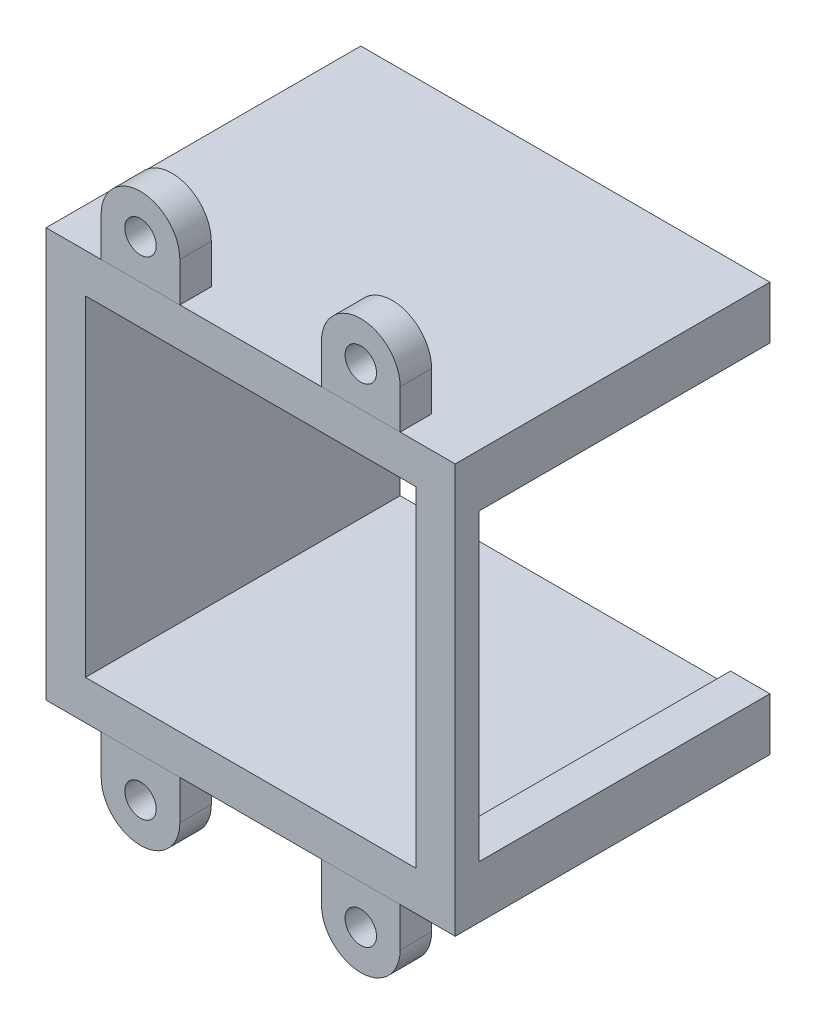
ISO-10303-21;
HEADER;
FILE_DESCRIPTION(('STEP AP214'),'2;1');
FILE_NAME('part.step','',(''),(''),'','','');
FILE_SCHEMA(('AUTOMOTIVE_DESIGN { 1 0 10303 214 1 1 1 1 }'));
ENDSEC;
DATA;
#1=APPLICATION_CONTEXT('core data for automotive mechanical design processes');
#2=APPLICATION_PROTOCOL_DEFINITION('international standard','automotive_design',2000,#1);
#3=PRODUCT_CONTEXT('',#1,'mechanical');
#4=PRODUCT('Part','Part','',(#3));
#5=PRODUCT_RELATED_PRODUCT_CATEGORY('part','',(#4));
#6=PRODUCT_DEFINITION_FORMATION('','',#4);
#7=PRODUCT_DEFINITION_CONTEXT('part definition',#1,'design');
#8=PRODUCT_DEFINITION('design','',#6,#7);
#9=PRODUCT_DEFINITION_SHAPE('','',#8);
#10=(LENGTH_UNIT() NAMED_UNIT(*) SI_UNIT(.MILLI.,.METRE.));
#11=(NAMED_UNIT(*) PLANE_ANGLE_UNIT() SI_UNIT($,.RADIAN.));
#12=(NAMED_UNIT(*) SI_UNIT($,.STERADIAN.) SOLID_ANGLE_UNIT());
#13=UNCERTAINTY_MEASURE_WITH_UNIT(LENGTH_MEASURE(1.E-05),#10,'distance_accuracy_value','');
#14=(GEOMETRIC_REPRESENTATION_CONTEXT(3) GLOBAL_UNCERTAINTY_ASSIGNED_CONTEXT((#13)) GLOBAL_UNIT_ASSIGNED_CONTEXT((#10,
#11,#12)) REPRESENTATION_CONTEXT('',''));
#15=CARTESIAN_POINT('',(0.,0.,0.));
#16=DIRECTION('',(0.,0.,1.));
#17=DIRECTION('',(1.,0.,0.));
#18=AXIS2_PLACEMENT_3D('',#15,#16,#17);
#19=CARTESIAN_POINT('',(-13.9999999999999,-31.,36.));
#20=DIRECTION('',(0.,0.,1.));
#21=DIRECTION('',(1.,0.,0.));
#22=AXIS2_PLACEMENT_3D('',#19,#20,#21);
#23=CYLINDRICAL_SURFACE('',#22,5.);
#24=CARTESIAN_POINT('',(-13.9999999999999,-31.,40.));
#25=DIRECTION('',(0.,0.,1.));
#26=DIRECTION('',(1.,0.,0.));
#27=AXIS2_PLACEMENT_3D('',#24,#25,#26);
#28=CIRCLE('',#27,5.);
#29=CARTESIAN_POINT('',(-18.9999999999999,-31.,40.));
#30=VERTEX_POINT('',#29);
#31=CARTESIAN_POINT('',(-8.99999999999991,-31.,40.));
#32=VERTEX_POINT('',#31);
#33=EDGE_CURVE('E109',#30,#32,#28,.T.);
#34=ORIENTED_EDGE('',*,*,#33,.F.);
#35=DIRECTION('',(0.,0.,1.));
#36=VECTOR('',#35,1.);
#37=CARTESIAN_POINT('',(-18.9999999999999,-31.,36.));
#38=LINE('',#37,#36);
#39=CARTESIAN_POINT('',(-18.9999999999999,-31.,36.));
#40=VERTEX_POINT('',#39);
#41=EDGE_CURVE('E12',#40,#30,#38,.T.);
#42=ORIENTED_EDGE('',*,*,#41,.F.);
#43=CARTESIAN_POINT('',(-13.9999999999999,-31.,36.));
#44=DIRECTION('',(0.,0.,1.));
#45=DIRECTION('',(1.,0.,0.));
#46=AXIS2_PLACEMENT_3D('',#43,#44,#45);
#47=CIRCLE('',#46,5.);
#48=CARTESIAN_POINT('',(-8.99999999999991,-31.,36.));
#49=VERTEX_POINT('',#48);
#50=EDGE_CURVE('E102',#40,#49,#47,.T.);
#51=ORIENTED_EDGE('',*,*,#50,.T.);
#52=DIRECTION('',(0.,0.,1.));
#53=VECTOR('',#52,1.);
#54=CARTESIAN_POINT('',(-8.99999999999991,-31.,36.));
#55=LINE('',#54,#53);
#56=EDGE_CURVE('E47',#49,#32,#55,.T.);
#57=ORIENTED_EDGE('',*,*,#56,.T.);
#58=EDGE_LOOP('',(#34,#42,#51,#57));
#59=FACE_BOUND('',#58,.T.);
#60=ADVANCED_FACE('F44',(#59),#23,.T.);
#61=CARTESIAN_POINT('',(-18.9999999999999,-26.,36.));
#62=DIRECTION('',(-1.,0.,0.));
#63=DIRECTION('',(0.,0.,1.));
#64=AXIS2_PLACEMENT_3D('',#61,#62,#63);
#65=PLANE('',#64);
#66=DIRECTION('',(0.,-1.,0.));
#67=VECTOR('',#66,1.);
#68=CARTESIAN_POINT('',(-18.9999999999999,-26.,40.));
#69=LINE('',#68,#67);
#70=CARTESIAN_POINT('',(-18.9999999999999,-26.,40.));
#71=VERTEX_POINT('',#70);
#72=EDGE_CURVE('E104',#71,#30,#69,.T.);
#73=ORIENTED_EDGE('',*,*,#72,.F.);
#74=DIRECTION('',(0.,0.,1.));
#75=VECTOR('',#74,1.);
#76=CARTESIAN_POINT('',(-18.9999999999999,-26.,36.));
#77=LINE('',#76,#75);
#78=CARTESIAN_POINT('',(-18.9999999999999,-26.,36.));
#79=VERTEX_POINT('',#78);
#80=EDGE_CURVE('E53',#79,#71,#77,.T.);
#81=ORIENTED_EDGE('',*,*,#80,.F.);
#82=DIRECTION('',(0.,-1.,0.));
#83=VECTOR('',#82,1.);
#84=CARTESIAN_POINT('',(-18.9999999999999,-26.,36.));
#85=LINE('',#84,#83);
#86=EDGE_CURVE('E99',#79,#40,#85,.T.);
#87=ORIENTED_EDGE('',*,*,#86,.T.);
#88=ORIENTED_EDGE('',*,*,#41,.T.);
#89=EDGE_LOOP('',(#73,#81,#87,#88));
#90=FACE_BOUND('',#89,.T.);
#91=ADVANCED_FACE('F120',(#90),#65,.T.);
#92=CARTESIAN_POINT('',(-8.99999999999991,-26.,36.));
#93=DIRECTION('',(0.,1.,0.));
#94=DIRECTION('',(-1.,0.,0.));
#95=AXIS2_PLACEMENT_3D('',#92,#93,#94);
#96=PLANE('',#95);
#97=DIRECTION('',(-1.,0.,0.));
#98=VECTOR('',#97,1.);
#99=CARTESIAN_POINT('',(-8.99999999999991,-26.,40.));
#100=LINE('',#99,#98);
#101=CARTESIAN_POINT('',(-8.99999999999991,-26.,40.));
#102=VERTEX_POINT('',#101);
#103=EDGE_CURVE('E94',#102,#71,#100,.T.);
#104=ORIENTED_EDGE('',*,*,#103,.F.);
#105=DIRECTION('',(0.,0.,1.));
#106=VECTOR('',#105,1.);
#107=CARTESIAN_POINT('',(-8.99999999999991,-26.,36.));
#108=LINE('',#107,#106);
#109=CARTESIAN_POINT('',(-8.99999999999991,-26.,36.));
#110=VERTEX_POINT('',#109);
#111=EDGE_CURVE('E89',#110,#102,#108,.T.);
#112=ORIENTED_EDGE('',*,*,#111,.F.);
#113=DIRECTION('',(-1.,0.,0.));
#114=VECTOR('',#113,1.);
#115=CARTESIAN_POINT('',(-8.99999999999991,-26.,36.));
#116=LINE('',#115,#114);
#117=EDGE_CURVE('E92',#110,#79,#116,.T.);
#118=ORIENTED_EDGE('',*,*,#117,.T.);
#119=ORIENTED_EDGE('',*,*,#80,.T.);
#120=EDGE_LOOP('',(#104,#112,#118,#119));
#121=FACE_BOUND('',#120,.T.);
#122=ADVANCED_FACE('F91',(#121),#96,.T.);
#123=CARTESIAN_POINT('',(-8.99999999999991,-31.,36.));
#124=DIRECTION('',(1.,0.,0.));
#125=DIRECTION('',(0.,0.,-1.));
#126=AXIS2_PLACEMENT_3D('',#123,#124,#125);
#127=PLANE('',#126);
#128=DIRECTION('',(0.,1.,0.));
#129=VECTOR('',#128,1.);
#130=CARTESIAN_POINT('',(-8.99999999999991,-31.,40.));
#131=LINE('',#130,#129);
#132=EDGE_CURVE('E112',#32,#102,#131,.T.);
#133=ORIENTED_EDGE('',*,*,#132,.F.);
#134=ORIENTED_EDGE('',*,*,#56,.F.);
#135=DIRECTION('',(0.,1.,0.));
#136=VECTOR('',#135,1.);
#137=CARTESIAN_POINT('',(-8.99999999999991,-31.,36.));
#138=LINE('',#137,#136);
#139=EDGE_CURVE('E98',#49,#110,#138,.T.);
#140=ORIENTED_EDGE('',*,*,#139,.T.);
#141=ORIENTED_EDGE('',*,*,#111,.T.);
#142=EDGE_LOOP('',(#133,#134,#140,#141));
#143=FACE_BOUND('',#142,.T.);
#144=ADVANCED_FACE('F101',(#143),#127,.T.);
#145=CARTESIAN_POINT('',(-13.9999999999999,-31.,36.));
#146=DIRECTION('',(0.,0.,1.));
#147=DIRECTION('',(1.,0.,0.));
#148=AXIS2_PLACEMENT_3D('',#145,#146,#147);
#149=PLANE('',#148);
#150=CARTESIAN_POINT('',(-13.9999999999999,-31.,36.));
#151=DIRECTION('',(0.,0.,1.));
#152=DIRECTION('',(-1.,0.,0.));
#153=AXIS2_PLACEMENT_3D('',#150,#151,#152);
#154=CIRCLE('',#153,2.);
#155=CARTESIAN_POINT('',(-15.9999999999999,-31.,36.));
#156=VERTEX_POINT('',#155);
#157=EDGE_CURVE('E113',#156,#156,#154,.T.);
#158=ORIENTED_EDGE('',*,*,#157,.T.);
#159=EDGE_LOOP('',(#158));
#160=FACE_BOUND('',#159,.T.);
#161=ORIENTED_EDGE('',*,*,#50,.F.);
#162=ORIENTED_EDGE('',*,*,#86,.F.);
#163=ORIENTED_EDGE('',*,*,#117,.F.);
#164=ORIENTED_EDGE('',*,*,#139,.F.);
#165=EDGE_LOOP('',(#161,#162,#163,#164));
#166=FACE_BOUND('',#165,.T.);
#167=ADVANCED_FACE('F97',(#160,#166),#149,.F.);
#168=CARTESIAN_POINT('',(-13.9999999999999,-31.,40.));
#169=DIRECTION('',(0.,0.,1.));
#170=DIRECTION('',(1.,0.,0.));
#171=AXIS2_PLACEMENT_3D('',#168,#169,#170);
#172=PLANE('',#171);
#173=CARTESIAN_POINT('',(-13.9999999999999,-31.,40.));
#174=DIRECTION('',(0.,0.,1.));
#175=DIRECTION('',(-1.,0.,0.));
#176=AXIS2_PLACEMENT_3D('',#173,#174,#175);
#177=CIRCLE('',#176,2.);
#178=CARTESIAN_POINT('',(-15.9999999999999,-31.,40.));
#179=VERTEX_POINT('',#178);
#180=EDGE_CURVE('E150',#179,#179,#177,.T.);
#181=ORIENTED_EDGE('',*,*,#180,.F.);
#182=EDGE_LOOP('',(#181));
#183=FACE_BOUND('',#182,.T.);
#184=ORIENTED_EDGE('',*,*,#33,.T.);
#185=ORIENTED_EDGE('',*,*,#132,.T.);
#186=ORIENTED_EDGE('',*,*,#103,.T.);
#187=ORIENTED_EDGE('',*,*,#72,.T.);
#188=EDGE_LOOP('',(#184,#185,#186,#187));
#189=FACE_BOUND('',#188,.T.);
#190=ADVANCED_FACE('F119',(#183,#189),#172,.T.);
#191=CARTESIAN_POINT('',(-13.9999999999999,-31.,36.));
#192=DIRECTION('',(0.,0.,1.));
#193=DIRECTION('',(1.,0.,0.));
#194=AXIS2_PLACEMENT_3D('',#191,#192,#193);
#195=CYLINDRICAL_SURFACE('',#194,2.);
#196=ORIENTED_EDGE('',*,*,#157,.F.);
#197=EDGE_LOOP('',(#196));
#198=FACE_BOUND('',#197,.T.);
#199=ORIENTED_EDGE('',*,*,#180,.T.);
#200=EDGE_LOOP('',(#199));
#201=FACE_BOUND('',#200,.T.);
#202=ADVANCED_FACE('F138',(#198,#201),#195,.F.);
#203=CLOSED_SHELL('',(#60,#91,#122,#144,#167,#190,#202));
#204=MANIFOLD_SOLID_BREP('B2',#203);
#205=CARTESIAN_POINT('',(14.0000000000001,-31.,36.));
#206=DIRECTION('',(0.,0.,1.));
#207=DIRECTION('',(1.,0.,0.));
#208=AXIS2_PLACEMENT_3D('',#205,#206,#207);
#209=CYLINDRICAL_SURFACE('',#208,5.);
#210=CARTESIAN_POINT('',(14.0000000000001,-31.,40.));
#211=DIRECTION('',(0.,0.,1.));
#212=DIRECTION('',(1.,0.,0.));
#213=AXIS2_PLACEMENT_3D('',#210,#211,#212);
#214=CIRCLE('',#213,5.);
#215=CARTESIAN_POINT('',(9.00000000000009,-31.,40.));
#216=VERTEX_POINT('',#215);
#217=CARTESIAN_POINT('',(19.0000000000001,-31.,40.));
#218=VERTEX_POINT('',#217);
#219=EDGE_CURVE('E264',#216,#218,#214,.T.);
#220=ORIENTED_EDGE('',*,*,#219,.F.);
#221=DIRECTION('',(0.,0.,1.));
#222=VECTOR('',#221,1.);
#223=CARTESIAN_POINT('',(9.00000000000009,-31.,36.));
#224=LINE('',#223,#222);
#225=CARTESIAN_POINT('',(9.00000000000009,-31.,36.));
#226=VERTEX_POINT('',#225);
#227=EDGE_CURVE('E42',#226,#216,#224,.T.);
#228=ORIENTED_EDGE('',*,*,#227,.F.);
#229=CARTESIAN_POINT('',(14.0000000000001,-31.,36.));
#230=DIRECTION('',(0.,0.,1.));
#231=DIRECTION('',(1.,0.,0.));
#232=AXIS2_PLACEMENT_3D('',#229,#230,#231);
#233=CIRCLE('',#232,5.);
#234=CARTESIAN_POINT('',(19.0000000000001,-31.,36.));
#235=VERTEX_POINT('',#234);
#236=EDGE_CURVE('E257',#226,#235,#233,.T.);
#237=ORIENTED_EDGE('',*,*,#236,.T.);
#238=DIRECTION('',(0.,0.,1.));
#239=VECTOR('',#238,1.);
#240=CARTESIAN_POINT('',(19.0000000000001,-31.,36.));
#241=LINE('',#240,#239);
#242=EDGE_CURVE('E202',#235,#218,#241,.T.);
#243=ORIENTED_EDGE('',*,*,#242,.T.);
#244=EDGE_LOOP('',(#220,#228,#237,#243));
#245=FACE_BOUND('',#244,.T.);
#246=ADVANCED_FACE('F199',(#245),#209,.T.);
#247=CARTESIAN_POINT('',(9.00000000000009,-26.,36.));
#248=DIRECTION('',(-1.,0.,0.));
#249=DIRECTION('',(0.,0.,1.));
#250=AXIS2_PLACEMENT_3D('',#247,#248,#249);
#251=PLANE('',#250);
#252=DIRECTION('',(0.,-1.,0.));
#253=VECTOR('',#252,1.);
#254=CARTESIAN_POINT('',(9.00000000000009,-26.,40.));
#255=LINE('',#254,#253);
#256=CARTESIAN_POINT('',(9.00000000000009,-26.,40.));
#257=VERTEX_POINT('',#256);
#258=EDGE_CURVE('E259',#257,#216,#255,.T.);
#259=ORIENTED_EDGE('',*,*,#258,.F.);
#260=DIRECTION('',(0.,0.,1.));
#261=VECTOR('',#260,1.);
#262=CARTESIAN_POINT('',(9.00000000000009,-26.,36.));
#263=LINE('',#262,#261);
#264=CARTESIAN_POINT('',(9.00000000000009,-26.,36.));
#265=VERTEX_POINT('',#264);
#266=EDGE_CURVE('E208',#265,#257,#263,.T.);
#267=ORIENTED_EDGE('',*,*,#266,.F.);
#268=DIRECTION('',(0.,-1.,0.));
#269=VECTOR('',#268,1.);
#270=CARTESIAN_POINT('',(9.00000000000009,-26.,36.));
#271=LINE('',#270,#269);
#272=EDGE_CURVE('E254',#265,#226,#271,.T.);
#273=ORIENTED_EDGE('',*,*,#272,.T.);
#274=ORIENTED_EDGE('',*,*,#227,.T.);
#275=EDGE_LOOP('',(#259,#267,#273,#274));
#276=FACE_BOUND('',#275,.T.);
#277=ADVANCED_FACE('F275',(#276),#251,.T.);
#278=CARTESIAN_POINT('',(19.0000000000001,-26.,36.));
#279=DIRECTION('',(0.,1.,0.));
#280=DIRECTION('',(-1.,0.,0.));
#281=AXIS2_PLACEMENT_3D('',#278,#279,#280);
#282=PLANE('',#281);
#283=DIRECTION('',(-1.,0.,0.));
#284=VECTOR('',#283,1.);
#285=CARTESIAN_POINT('',(19.0000000000001,-26.,40.));
#286=LINE('',#285,#284);
#287=CARTESIAN_POINT('',(19.0000000000001,-26.,40.));
#288=VERTEX_POINT('',#287);
#289=EDGE_CURVE('E249',#288,#257,#286,.T.);
#290=ORIENTED_EDGE('',*,*,#289,.F.);
#291=DIRECTION('',(0.,0.,1.));
#292=VECTOR('',#291,1.);
#293=CARTESIAN_POINT('',(19.0000000000001,-26.,36.));
#294=LINE('',#293,#292);
#295=CARTESIAN_POINT('',(19.0000000000001,-26.,36.));
#296=VERTEX_POINT('',#295);
#297=EDGE_CURVE('E244',#296,#288,#294,.T.);
#298=ORIENTED_EDGE('',*,*,#297,.F.);
#299=DIRECTION('',(-1.,0.,0.));
#300=VECTOR('',#299,1.);
#301=CARTESIAN_POINT('',(19.0000000000001,-26.,36.));
#302=LINE('',#301,#300);
#303=EDGE_CURVE('E247',#296,#265,#302,.T.);
#304=ORIENTED_EDGE('',*,*,#303,.T.);
#305=ORIENTED_EDGE('',*,*,#266,.T.);
#306=EDGE_LOOP('',(#290,#298,#304,#305));
#307=FACE_BOUND('',#306,.T.);
#308=ADVANCED_FACE('F246',(#307),#282,.T.);
#309=CARTESIAN_POINT('',(19.0000000000001,-31.,36.));
#310=DIRECTION('',(1.,0.,0.));
#311=DIRECTION('',(0.,0.,-1.));
#312=AXIS2_PLACEMENT_3D('',#309,#310,#311);
#313=PLANE('',#312);
#314=DIRECTION('',(0.,1.,0.));
#315=VECTOR('',#314,1.);
#316=CARTESIAN_POINT('',(19.0000000000001,-31.,40.));
#317=LINE('',#316,#315);
#318=EDGE_CURVE('E267',#218,#288,#317,.T.);
#319=ORIENTED_EDGE('',*,*,#318,.F.);
#320=ORIENTED_EDGE('',*,*,#242,.F.);
#321=DIRECTION('',(0.,1.,0.));
#322=VECTOR('',#321,1.);
#323=CARTESIAN_POINT('',(19.0000000000001,-31.,36.));
#324=LINE('',#323,#322);
#325=EDGE_CURVE('E253',#235,#296,#324,.T.);
#326=ORIENTED_EDGE('',*,*,#325,.T.);
#327=ORIENTED_EDGE('',*,*,#297,.T.);
#328=EDGE_LOOP('',(#319,#320,#326,#327));
#329=FACE_BOUND('',#328,.T.);
#330=ADVANCED_FACE('F256',(#329),#313,.T.);
#331=CARTESIAN_POINT('',(14.0000000000001,-31.,36.));
#332=DIRECTION('',(0.,0.,1.));
#333=DIRECTION('',(1.,0.,0.));
#334=AXIS2_PLACEMENT_3D('',#331,#332,#333);
#335=PLANE('',#334);
#336=CARTESIAN_POINT('',(14.0000000000001,-31.,36.));
#337=DIRECTION('',(0.,0.,1.));
#338=DIRECTION('',(-1.,0.,0.));
#339=AXIS2_PLACEMENT_3D('',#336,#337,#338);
#340=CIRCLE('',#339,2.);
#341=CARTESIAN_POINT('',(12.0000000000001,-31.,36.));
#342=VERTEX_POINT('',#341);
#343=EDGE_CURVE('E268',#342,#342,#340,.T.);
#344=ORIENTED_EDGE('',*,*,#343,.T.);
#345=EDGE_LOOP('',(#344));
#346=FACE_BOUND('',#345,.T.);
#347=ORIENTED_EDGE('',*,*,#236,.F.);
#348=ORIENTED_EDGE('',*,*,#272,.F.);
#349=ORIENTED_EDGE('',*,*,#303,.F.);
#350=ORIENTED_EDGE('',*,*,#325,.F.);
#351=EDGE_LOOP('',(#347,#348,#349,#350));
#352=FACE_BOUND('',#351,.T.);
#353=ADVANCED_FACE('F252',(#346,#352),#335,.F.);
#354=CARTESIAN_POINT('',(14.0000000000001,-31.,40.));
#355=DIRECTION('',(0.,0.,1.));
#356=DIRECTION('',(1.,0.,0.));
#357=AXIS2_PLACEMENT_3D('',#354,#355,#356);
#358=PLANE('',#357);
#359=CARTESIAN_POINT('',(14.0000000000001,-31.,40.));
#360=DIRECTION('',(0.,0.,1.));
#361=DIRECTION('',(-1.,0.,0.));
#362=AXIS2_PLACEMENT_3D('',#359,#360,#361);
#363=CIRCLE('',#362,2.);
#364=CARTESIAN_POINT('',(12.0000000000001,-31.,40.));
#365=VERTEX_POINT('',#364);
#366=EDGE_CURVE('E305',#365,#365,#363,.T.);
#367=ORIENTED_EDGE('',*,*,#366,.F.);
#368=EDGE_LOOP('',(#367));
#369=FACE_BOUND('',#368,.T.);
#370=ORIENTED_EDGE('',*,*,#219,.T.);
#371=ORIENTED_EDGE('',*,*,#318,.T.);
#372=ORIENTED_EDGE('',*,*,#289,.T.);
#373=ORIENTED_EDGE('',*,*,#258,.T.);
#374=EDGE_LOOP('',(#370,#371,#372,#373));
#375=FACE_BOUND('',#374,.T.);
#376=ADVANCED_FACE('F274',(#369,#375),#358,.T.);
#377=CARTESIAN_POINT('',(14.0000000000001,-31.,36.));
#378=DIRECTION('',(0.,0.,1.));
#379=DIRECTION('',(1.,0.,0.));
#380=AXIS2_PLACEMENT_3D('',#377,#378,#379);
#381=CYLINDRICAL_SURFACE('',#380,2.);
#382=ORIENTED_EDGE('',*,*,#343,.F.);
#383=EDGE_LOOP('',(#382));
#384=FACE_BOUND('',#383,.T.);
#385=ORIENTED_EDGE('',*,*,#366,.T.);
#386=EDGE_LOOP('',(#385));
#387=FACE_BOUND('',#386,.T.);
#388=ADVANCED_FACE('F293',(#384,#387),#381,.F.);
#389=CLOSED_SHELL('',(#246,#277,#308,#330,#353,#376,#388));
#390=MANIFOLD_SOLID_BREP('B6',#389);
#391=CARTESIAN_POINT('',(9.00000000000009,26.,36.));
#392=DIRECTION('',(-1.,0.,0.));
#393=DIRECTION('',(0.,0.,1.));
#394=AXIS2_PLACEMENT_3D('',#391,#392,#393);
#395=PLANE('',#394);
#396=DIRECTION('',(0.,-1.,0.));
#397=VECTOR('',#396,1.);
#398=CARTESIAN_POINT('',(9.00000000000009,26.,40.));
#399=LINE('',#398,#397);
#400=CARTESIAN_POINT('',(9.00000000000009,31.,40.));
#401=VERTEX_POINT('',#400);
#402=CARTESIAN_POINT('',(9.00000000000009,26.,40.));
#403=VERTEX_POINT('',#402);
#404=EDGE_CURVE('E419',#401,#403,#399,.T.);
#405=ORIENTED_EDGE('',*,*,#404,.F.);
#406=DIRECTION('',(0.,0.,1.));
#407=VECTOR('',#406,1.);
#408=CARTESIAN_POINT('',(9.00000000000009,31.,36.));
#409=LINE('',#408,#407);
#410=CARTESIAN_POINT('',(9.00000000000009,31.,36.));
#411=VERTEX_POINT('',#410);
#412=EDGE_CURVE('E197',#411,#401,#409,.T.);
#413=ORIENTED_EDGE('',*,*,#412,.F.);
#414=DIRECTION('',(0.,-1.,0.));
#415=VECTOR('',#414,1.);
#416=CARTESIAN_POINT('',(9.00000000000009,26.,36.));
#417=LINE('',#416,#415);
#418=CARTESIAN_POINT('',(9.00000000000009,26.,36.));
#419=VERTEX_POINT('',#418);
#420=EDGE_CURVE('E412',#411,#419,#417,.T.);
#421=ORIENTED_EDGE('',*,*,#420,.T.);
#422=DIRECTION('',(0.,0.,1.));
#423=VECTOR('',#422,1.);
#424=CARTESIAN_POINT('',(9.00000000000009,26.,36.));
#425=LINE('',#424,#423);
#426=EDGE_CURVE('E357',#419,#403,#425,.T.);
#427=ORIENTED_EDGE('',*,*,#426,.T.);
#428=EDGE_LOOP('',(#405,#413,#421,#427));
#429=FACE_BOUND('',#428,.T.);
#430=ADVANCED_FACE('F354',(#429),#395,.T.);
#431=CARTESIAN_POINT('',(14.0000000000001,31.,36.));
#432=DIRECTION('',(0.,0.,1.));
#433=DIRECTION('',(1.,0.,0.));
#434=AXIS2_PLACEMENT_3D('',#431,#432,#433);
#435=CYLINDRICAL_SURFACE('',#434,5.);
#436=CARTESIAN_POINT('',(14.0000000000001,31.,40.));
#437=DIRECTION('',(0.,0.,1.));
#438=DIRECTION('',(-1.,0.,0.));
#439=AXIS2_PLACEMENT_3D('',#436,#437,#438);
#440=CIRCLE('',#439,5.);
#441=CARTESIAN_POINT('',(19.0000000000001,31.,40.));
#442=VERTEX_POINT('',#441);
#443=EDGE_CURVE('E414',#442,#401,#440,.T.);
#444=ORIENTED_EDGE('',*,*,#443,.F.);
#445=DIRECTION('',(0.,0.,1.));
#446=VECTOR('',#445,1.);
#447=CARTESIAN_POINT('',(19.0000000000001,31.,36.));
#448=LINE('',#447,#446);
#449=CARTESIAN_POINT('',(19.0000000000001,31.,36.));
#450=VERTEX_POINT('',#449);
#451=EDGE_CURVE('E363',#450,#442,#448,.T.);
#452=ORIENTED_EDGE('',*,*,#451,.F.);
#453=CARTESIAN_POINT('',(14.0000000000001,31.,36.));
#454=DIRECTION('',(0.,0.,1.));
#455=DIRECTION('',(-1.,0.,0.));
#456=AXIS2_PLACEMENT_3D('',#453,#454,#455);
#457=CIRCLE('',#456,5.);
#458=EDGE_CURVE('E409',#450,#411,#457,.T.);
#459=ORIENTED_EDGE('',*,*,#458,.T.);
#460=ORIENTED_EDGE('',*,*,#412,.T.);
#461=EDGE_LOOP('',(#444,#452,#459,#460));
#462=FACE_BOUND('',#461,.T.);
#463=ADVANCED_FACE('F430',(#462),#435,.T.);
#464=CARTESIAN_POINT('',(19.0000000000001,31.,36.));
#465=DIRECTION('',(1.,0.,0.));
#466=DIRECTION('',(0.,0.,-1.));
#467=AXIS2_PLACEMENT_3D('',#464,#465,#466);
#468=PLANE('',#467);
#469=DIRECTION('',(0.,1.,0.));
#470=VECTOR('',#469,1.);
#471=CARTESIAN_POINT('',(19.0000000000001,31.,40.));
#472=LINE('',#471,#470);
#473=CARTESIAN_POINT('',(19.0000000000001,26.,40.));
#474=VERTEX_POINT('',#473);
#475=EDGE_CURVE('E404',#474,#442,#472,.T.);
#476=ORIENTED_EDGE('',*,*,#475,.F.);
#477=DIRECTION('',(0.,0.,1.));
#478=VECTOR('',#477,1.);
#479=CARTESIAN_POINT('',(19.0000000000001,26.,36.));
#480=LINE('',#479,#478);
#481=CARTESIAN_POINT('',(19.0000000000001,26.,36.));
#482=VERTEX_POINT('',#481);
#483=EDGE_CURVE('E399',#482,#474,#480,.T.);
#484=ORIENTED_EDGE('',*,*,#483,.F.);
#485=DIRECTION('',(0.,1.,0.));
#486=VECTOR('',#485,1.);
#487=CARTESIAN_POINT('',(19.0000000000001,31.,36.));
#488=LINE('',#487,#486);
#489=EDGE_CURVE('E402',#482,#450,#488,.T.);
#490=ORIENTED_EDGE('',*,*,#489,.T.);
#491=ORIENTED_EDGE('',*,*,#451,.T.);
#492=EDGE_LOOP('',(#476,#484,#490,#491));
#493=FACE_BOUND('',#492,.T.);
#494=ADVANCED_FACE('F401',(#493),#468,.T.);
#495=CARTESIAN_POINT('',(19.0000000000001,26.,36.));
#496=DIRECTION('',(0.,-1.,0.));
#497=DIRECTION('',(1.,0.,0.));
#498=AXIS2_PLACEMENT_3D('',#495,#496,#497);
#499=PLANE('',#498);
#500=DIRECTION('',(1.,0.,0.));
#501=VECTOR('',#500,1.);
#502=CARTESIAN_POINT('',(19.0000000000001,26.,40.));
#503=LINE('',#502,#501);
#504=EDGE_CURVE('E422',#403,#474,#503,.T.);
#505=ORIENTED_EDGE('',*,*,#504,.F.);
#506=ORIENTED_EDGE('',*,*,#426,.F.);
#507=DIRECTION('',(1.,0.,0.));
#508=VECTOR('',#507,1.);
#509=CARTESIAN_POINT('',(19.0000000000001,26.,36.));
#510=LINE('',#509,#508);
#511=EDGE_CURVE('E408',#419,#482,#510,.T.);
#512=ORIENTED_EDGE('',*,*,#511,.T.);
#513=ORIENTED_EDGE('',*,*,#483,.T.);
#514=EDGE_LOOP('',(#505,#506,#512,#513));
#515=FACE_BOUND('',#514,.T.);
#516=ADVANCED_FACE('F411',(#515),#499,.T.);
#517=CARTESIAN_POINT('',(14.0000000000001,31.,36.));
#518=DIRECTION('',(0.,0.,-1.));
#519=DIRECTION('',(-1.,0.,0.));
#520=AXIS2_PLACEMENT_3D('',#517,#518,#519);
#521=PLANE('',#520);
#522=CARTESIAN_POINT('',(14.0000000000001,31.,36.));
#523=DIRECTION('',(0.,0.,1.));
#524=DIRECTION('',(1.,0.,0.));
#525=AXIS2_PLACEMENT_3D('',#522,#523,#524);
#526=CIRCLE('',#525,2.);
#527=CARTESIAN_POINT('',(16.0000000000001,31.,36.));
#528=VERTEX_POINT('',#527);
#529=EDGE_CURVE('E423',#528,#528,#526,.T.);
#530=ORIENTED_EDGE('',*,*,#529,.T.);
#531=EDGE_LOOP('',(#530));
#532=FACE_BOUND('',#531,.T.);
#533=ORIENTED_EDGE('',*,*,#420,.F.);
#534=ORIENTED_EDGE('',*,*,#458,.F.);
#535=ORIENTED_EDGE('',*,*,#489,.F.);
#536=ORIENTED_EDGE('',*,*,#511,.F.);
#537=EDGE_LOOP('',(#533,#534,#535,#536));
#538=FACE_BOUND('',#537,.T.);
#539=ADVANCED_FACE('F407',(#532,#538),#521,.T.);
#540=CARTESIAN_POINT('',(14.0000000000001,31.,40.));
#541=DIRECTION('',(0.,0.,-1.));
#542=DIRECTION('',(-1.,0.,0.));
#543=AXIS2_PLACEMENT_3D('',#540,#541,#542);
#544=PLANE('',#543);
#545=CARTESIAN_POINT('',(14.0000000000001,31.,40.));
#546=DIRECTION('',(0.,0.,1.));
#547=DIRECTION('',(1.,0.,0.));
#548=AXIS2_PLACEMENT_3D('',#545,#546,#547);
#549=CIRCLE('',#548,2.);
#550=CARTESIAN_POINT('',(16.0000000000001,31.,40.));
#551=VERTEX_POINT('',#550);
#552=EDGE_CURVE('E460',#551,#551,#549,.T.);
#553=ORIENTED_EDGE('',*,*,#552,.F.);
#554=EDGE_LOOP('',(#553));
#555=FACE_BOUND('',#554,.T.);
#556=ORIENTED_EDGE('',*,*,#404,.T.);
#557=ORIENTED_EDGE('',*,*,#504,.T.);
#558=ORIENTED_EDGE('',*,*,#475,.T.);
#559=ORIENTED_EDGE('',*,*,#443,.T.);
#560=EDGE_LOOP('',(#556,#557,#558,#559));
#561=FACE_BOUND('',#560,.T.);
#562=ADVANCED_FACE('F429',(#555,#561),#544,.F.);
#563=CARTESIAN_POINT('',(14.0000000000001,31.,36.));
#564=DIRECTION('',(0.,0.,1.));
#565=DIRECTION('',(1.,0.,0.));
#566=AXIS2_PLACEMENT_3D('',#563,#564,#565);
#567=CYLINDRICAL_SURFACE('',#566,2.);
#568=ORIENTED_EDGE('',*,*,#529,.F.);
#569=EDGE_LOOP('',(#568));
#570=FACE_BOUND('',#569,.T.);
#571=ORIENTED_EDGE('',*,*,#552,.T.);
#572=EDGE_LOOP('',(#571));
#573=FACE_BOUND('',#572,.T.);
#574=ADVANCED_FACE('F448',(#570,#573),#567,.F.);
#575=CLOSED_SHELL('',(#430,#463,#494,#516,#539,#562,#574));
#576=MANIFOLD_SOLID_BREP('B36',#575);
#577=CARTESIAN_POINT('',(-8.99999999999991,26.,36.));
#578=DIRECTION('',(0.,-1.,0.));
#579=DIRECTION('',(1.,0.,0.));
#580=AXIS2_PLACEMENT_3D('',#577,#578,#579);
#581=PLANE('',#580);
#582=DIRECTION('',(1.,0.,0.));
#583=VECTOR('',#582,1.);
#584=CARTESIAN_POINT('',(-8.99999999999991,26.,40.));
#585=LINE('',#584,#583);
#586=CARTESIAN_POINT('',(-18.9999999999999,26.,40.));
#587=VERTEX_POINT('',#586);
#588=CARTESIAN_POINT('',(-8.99999999999991,26.,40.));
#589=VERTEX_POINT('',#588);
#590=EDGE_CURVE('E573',#587,#589,#585,.T.);
#591=ORIENTED_EDGE('',*,*,#590,.F.);
#592=DIRECTION('',(0.,0.,1.));
#593=VECTOR('',#592,1.);
#594=CARTESIAN_POINT('',(-18.9999999999999,26.,36.));
#595=LINE('',#594,#593);
#596=CARTESIAN_POINT('',(-18.9999999999999,26.,36.));
#597=VERTEX_POINT('',#596);
#598=EDGE_CURVE('E352',#597,#587,#595,.T.);
#599=ORIENTED_EDGE('',*,*,#598,.F.);
#600=DIRECTION('',(1.,0.,0.));
#601=VECTOR('',#600,1.);
#602=CARTESIAN_POINT('',(-8.99999999999991,26.,36.));
#603=LINE('',#602,#601);
#604=CARTESIAN_POINT('',(-8.99999999999991,26.,36.));
#605=VERTEX_POINT('',#604);
#606=EDGE_CURVE('E566',#597,#605,#603,.T.);
#607=ORIENTED_EDGE('',*,*,#606,.T.);
#608=DIRECTION('',(0.,0.,1.));
#609=VECTOR('',#608,1.);
#610=CARTESIAN_POINT('',(-8.99999999999991,26.,36.));
#611=LINE('',#610,#609);
#612=EDGE_CURVE('E511',#605,#589,#611,.T.);
#613=ORIENTED_EDGE('',*,*,#612,.T.);
#614=EDGE_LOOP('',(#591,#599,#607,#613));
#615=FACE_BOUND('',#614,.T.);
#616=ADVANCED_FACE('F508',(#615),#581,.T.);
#617=CARTESIAN_POINT('',(-18.9999999999999,26.,36.));
#618=DIRECTION('',(-1.,0.,0.));
#619=DIRECTION('',(0.,0.,1.));
#620=AXIS2_PLACEMENT_3D('',#617,#618,#619);
#621=PLANE('',#620);
#622=DIRECTION('',(0.,-1.,0.));
#623=VECTOR('',#622,1.);
#624=CARTESIAN_POINT('',(-18.9999999999999,26.,40.));
#625=LINE('',#624,#623);
#626=CARTESIAN_POINT('',(-18.9999999999999,31.,40.));
#627=VERTEX_POINT('',#626);
#628=EDGE_CURVE('E568',#627,#587,#625,.T.);
#629=ORIENTED_EDGE('',*,*,#628,.F.);
#630=DIRECTION('',(0.,0.,1.));
#631=VECTOR('',#630,1.);
#632=CARTESIAN_POINT('',(-18.9999999999999,31.,36.));
#633=LINE('',#632,#631);
#634=CARTESIAN_POINT('',(-18.9999999999999,31.,36.));
#635=VERTEX_POINT('',#634);
#636=EDGE_CURVE('E517',#635,#627,#633,.T.);
#637=ORIENTED_EDGE('',*,*,#636,.F.);
#638=DIRECTION('',(0.,-1.,0.));
#639=VECTOR('',#638,1.);
#640=CARTESIAN_POINT('',(-18.9999999999999,26.,36.));
#641=LINE('',#640,#639);
#642=EDGE_CURVE('E563',#635,#597,#641,.T.);
#643=ORIENTED_EDGE('',*,*,#642,.T.);
#644=ORIENTED_EDGE('',*,*,#598,.T.);
#645=EDGE_LOOP('',(#629,#637,#643,#644));
#646=FACE_BOUND('',#645,.T.);
#647=ADVANCED_FACE('F584',(#646),#621,.T.);
#648=CARTESIAN_POINT('',(-13.9999999999999,31.,36.));
#649=DIRECTION('',(0.,0.,1.));
#650=DIRECTION('',(1.,0.,0.));
#651=AXIS2_PLACEMENT_3D('',#648,#649,#650);
#652=CYLINDRICAL_SURFACE('',#651,5.);
#653=CARTESIAN_POINT('',(-13.9999999999999,31.,40.));
#654=DIRECTION('',(0.,0.,1.));
#655=DIRECTION('',(-1.,0.,0.));
#656=AXIS2_PLACEMENT_3D('',#653,#654,#655);
#657=CIRCLE('',#656,5.);
#658=CARTESIAN_POINT('',(-8.9999999999999,31.,40.));
#659=VERTEX_POINT('',#658);
#660=EDGE_CURVE('E558',#659,#627,#657,.T.);
#661=ORIENTED_EDGE('',*,*,#660,.F.);
#662=DIRECTION('',(0.,0.,1.));
#663=VECTOR('',#662,1.);
#664=CARTESIAN_POINT('',(-8.9999999999999,31.,36.));
#665=LINE('',#664,#663);
#666=CARTESIAN_POINT('',(-8.9999999999999,31.,36.));
#667=VERTEX_POINT('',#666);
#668=EDGE_CURVE('E553',#667,#659,#665,.T.);
#669=ORIENTED_EDGE('',*,*,#668,.F.);
#670=CARTESIAN_POINT('',(-13.9999999999999,31.,36.));
#671=DIRECTION('',(0.,0.,1.));
#672=DIRECTION('',(-1.,0.,0.));
#673=AXIS2_PLACEMENT_3D('',#670,#671,#672);
#674=CIRCLE('',#673,5.);
#675=EDGE_CURVE('E556',#667,#635,#674,.T.);
#676=ORIENTED_EDGE('',*,*,#675,.T.);
#677=ORIENTED_EDGE('',*,*,#636,.T.);
#678=EDGE_LOOP('',(#661,#669,#676,#677));
#679=FACE_BOUND('',#678,.T.);
#680=ADVANCED_FACE('F555',(#679),#652,.T.);
#681=CARTESIAN_POINT('',(-8.99999999999991,31.,36.));
#682=DIRECTION('',(1.,0.,0.));
#683=DIRECTION('',(0.,0.,-1.));
#684=AXIS2_PLACEMENT_3D('',#681,#682,#683);
#685=PLANE('',#684);
#686=DIRECTION('',(0.,1.,0.));
#687=VECTOR('',#686,1.);
#688=CARTESIAN_POINT('',(-8.99999999999991,31.,40.));
#689=LINE('',#688,#687);
#690=EDGE_CURVE('E576',#589,#659,#689,.T.);
#691=ORIENTED_EDGE('',*,*,#690,.F.);
#692=ORIENTED_EDGE('',*,*,#612,.F.);
#693=DIRECTION('',(0.,1.,0.));
#694=VECTOR('',#693,1.);
#695=CARTESIAN_POINT('',(-8.99999999999991,31.,36.));
#696=LINE('',#695,#694);
#697=EDGE_CURVE('E562',#605,#667,#696,.T.);
#698=ORIENTED_EDGE('',*,*,#697,.T.);
#699=ORIENTED_EDGE('',*,*,#668,.T.);
#700=EDGE_LOOP('',(#691,#692,#698,#699));
#701=FACE_BOUND('',#700,.T.);
#702=ADVANCED_FACE('F565',(#701),#685,.T.);
#703=CARTESIAN_POINT('',(-13.9999999999999,31.,36.));
#704=DIRECTION('',(0.,0.,-1.));
#705=DIRECTION('',(-1.,0.,0.));
#706=AXIS2_PLACEMENT_3D('',#703,#704,#705);
#707=PLANE('',#706);
#708=CARTESIAN_POINT('',(-13.9999999999999,31.,36.));
#709=DIRECTION('',(0.,0.,1.));
#710=DIRECTION('',(1.,0.,0.));
#711=AXIS2_PLACEMENT_3D('',#708,#709,#710);
#712=CIRCLE('',#711,2.);
#713=CARTESIAN_POINT('',(-11.9999999999999,31.,36.));
#714=VERTEX_POINT('',#713);
#715=EDGE_CURVE('E577',#714,#714,#712,.T.);
#716=ORIENTED_EDGE('',*,*,#715,.T.);
#717=EDGE_LOOP('',(#716));
#718=FACE_BOUND('',#717,.T.);
#719=ORIENTED_EDGE('',*,*,#606,.F.);
#720=ORIENTED_EDGE('',*,*,#642,.F.);
#721=ORIENTED_EDGE('',*,*,#675,.F.);
#722=ORIENTED_EDGE('',*,*,#697,.F.);
#723=EDGE_LOOP('',(#719,#720,#721,#722));
#724=FACE_BOUND('',#723,.T.);
#725=ADVANCED_FACE('F561',(#718,#724),#707,.T.);
#726=CARTESIAN_POINT('',(-13.9999999999999,31.,40.));
#727=DIRECTION('',(0.,0.,-1.));
#728=DIRECTION('',(-1.,0.,0.));
#729=AXIS2_PLACEMENT_3D('',#726,#727,#728);
#730=PLANE('',#729);
#731=CARTESIAN_POINT('',(-13.9999999999999,31.,40.));
#732=DIRECTION('',(0.,0.,1.));
#733=DIRECTION('',(1.,0.,0.));
#734=AXIS2_PLACEMENT_3D('',#731,#732,#733);
#735=CIRCLE('',#734,2.);
#736=CARTESIAN_POINT('',(-11.9999999999999,31.,40.));
#737=VERTEX_POINT('',#736);
#738=EDGE_CURVE('E614',#737,#737,#735,.T.);
#739=ORIENTED_EDGE('',*,*,#738,.F.);
#740=EDGE_LOOP('',(#739));
#741=FACE_BOUND('',#740,.T.);
#742=ORIENTED_EDGE('',*,*,#590,.T.);
#743=ORIENTED_EDGE('',*,*,#690,.T.);
#744=ORIENTED_EDGE('',*,*,#660,.T.);
#745=ORIENTED_EDGE('',*,*,#628,.T.);
#746=EDGE_LOOP('',(#742,#743,#744,#745));
#747=FACE_BOUND('',#746,.T.);
#748=ADVANCED_FACE('F583',(#741,#747),#730,.F.);
#749=CARTESIAN_POINT('',(-13.9999999999999,31.,36.));
#750=DIRECTION('',(0.,0.,1.));
#751=DIRECTION('',(1.,0.,0.));
#752=AXIS2_PLACEMENT_3D('',#749,#750,#751);
#753=CYLINDRICAL_SURFACE('',#752,2.);
#754=ORIENTED_EDGE('',*,*,#715,.F.);
#755=EDGE_LOOP('',(#754));
#756=FACE_BOUND('',#755,.T.);
#757=ORIENTED_EDGE('',*,*,#738,.T.);
#758=EDGE_LOOP('',(#757));
#759=FACE_BOUND('',#758,.T.);
#760=ADVANCED_FACE('F602',(#756,#759),#753,.F.);
#761=CLOSED_SHELL('',(#616,#647,#680,#702,#725,#748,#760));
#762=MANIFOLD_SOLID_BREP('B191',#761);
#763=CARTESIAN_POINT('',(0.,0.,40.));
#764=DIRECTION('',(0.,0.,-1.));
#765=DIRECTION('',(-1.,0.,0.));
#766=AXIS2_PLACEMENT_3D('',#763,#764,#765);
#767=PLANE('',#766);
#768=DIRECTION('',(0.,1.,0.));
#769=VECTOR('',#768,1.);
#770=CARTESIAN_POINT('',(26.,-26.,40.));
#771=LINE('',#770,#769);
#772=CARTESIAN_POINT('',(26.,-26.,40.));
#773=VERTEX_POINT('',#772);
#774=CARTESIAN_POINT('',(26.,26.,40.));
#775=VERTEX_POINT('',#774);
#776=EDGE_CURVE('E783',#773,#775,#771,.T.);
#777=ORIENTED_EDGE('',*,*,#776,.T.);
#778=DIRECTION('',(-1.,0.,0.));
#779=VECTOR('',#778,1.);
#780=CARTESIAN_POINT('',(-26.,26.,40.));
#781=LINE('',#780,#779);
#782=CARTESIAN_POINT('',(-26.,26.,40.));
#783=VERTEX_POINT('',#782);
#784=EDGE_CURVE('E803',#775,#783,#781,.T.);
#785=ORIENTED_EDGE('',*,*,#784,.T.);
#786=DIRECTION('',(0.,-1.,0.));
#787=VECTOR('',#786,1.);
#788=CARTESIAN_POINT('',(-26.,-26.,40.));
#789=LINE('',#788,#787);
#790=CARTESIAN_POINT('',(-26.,-26.,40.));
#791=VERTEX_POINT('',#790);
#792=EDGE_CURVE('E794',#783,#791,#789,.T.);
#793=ORIENTED_EDGE('',*,*,#792,.T.);
#794=DIRECTION('',(1.,0.,0.));
#795=VECTOR('',#794,1.);
#796=CARTESIAN_POINT('',(-26.,-26.,40.));
#797=LINE('',#796,#795);
#798=EDGE_CURVE('E777',#791,#773,#797,.T.);
#799=ORIENTED_EDGE('',*,*,#798,.T.);
#800=EDGE_LOOP('',(#777,#785,#793,#799));
#801=FACE_BOUND('',#800,.T.);
#802=DIRECTION('',(0.,1.,0.));
#803=VECTOR('',#802,1.);
#804=CARTESIAN_POINT('',(21.0000000000001,-20.9999999999999,40.));
#805=LINE('',#804,#803);
#806=CARTESIAN_POINT('',(21.0000000000001,-20.9999999999999,40.));
#807=VERTEX_POINT('',#806);
#808=CARTESIAN_POINT('',(21.0000000000001,21.0000000000001,40.));
#809=VERTEX_POINT('',#808);
#810=EDGE_CURVE('E818',#807,#809,#805,.T.);
#811=ORIENTED_EDGE('',*,*,#810,.F.);
#812=DIRECTION('',(1.,0.,0.));
#813=VECTOR('',#812,1.);
#814=CARTESIAN_POINT('',(-20.9999999999999,-20.9999999999999,40.));
#815=LINE('',#814,#813);
#816=CARTESIAN_POINT('',(-20.9999999999999,-20.9999999999999,40.));
#817=VERTEX_POINT('',#816);
#818=EDGE_CURVE('E815',#817,#807,#815,.T.);
#819=ORIENTED_EDGE('',*,*,#818,.F.);
#820=DIRECTION('',(0.,-1.,0.));
#821=VECTOR('',#820,1.);
#822=CARTESIAN_POINT('',(-20.9999999999999,-20.9999999999999,40.));
#823=LINE('',#822,#821);
#824=CARTESIAN_POINT('',(-20.9999999999999,21.0000000000001,40.));
#825=VERTEX_POINT('',#824);
#826=EDGE_CURVE('E827',#825,#817,#823,.T.);
#827=ORIENTED_EDGE('',*,*,#826,.F.);
#828=DIRECTION('',(-1.,0.,0.));
#829=VECTOR('',#828,1.);
#830=CARTESIAN_POINT('',(-20.9999999999999,21.0000000000001,40.));
#831=LINE('',#830,#829);
#832=EDGE_CURVE('E829',#809,#825,#831,.T.);
#833=ORIENTED_EDGE('',*,*,#832,.F.);
#834=EDGE_LOOP('',(#811,#819,#827,#833));
#835=FACE_BOUND('',#834,.T.);
#836=ADVANCED_FACE('F653',(#801,#835),#767,.F.);
#837=CARTESIAN_POINT('',(0.,0.,0.));
#838=DIRECTION('',(0.,0.,-1.));
#839=DIRECTION('',(-1.,0.,0.));
#840=AXIS2_PLACEMENT_3D('',#837,#838,#839);
#841=PLANE('',#840);
#842=DIRECTION('',(1.,0.,0.));
#843=VECTOR('',#842,1.);
#844=CARTESIAN_POINT('',(-26.001,-19.3,0.));
#845=LINE('',#844,#843);
#846=CARTESIAN_POINT('',(21.0000000000001,-19.3,0.));
#847=VERTEX_POINT('',#846);
#848=CARTESIAN_POINT('',(26.,-19.3,0.));
#849=VERTEX_POINT('',#848);
#850=EDGE_CURVE('E744',#847,#849,#845,.T.);
#851=ORIENTED_EDGE('',*,*,#850,.T.);
#852=DIRECTION('',(0.,1.,0.));
#853=VECTOR('',#852,1.);
#854=CARTESIAN_POINT('',(26.,-26.,0.));
#855=LINE('',#854,#853);
#856=CARTESIAN_POINT('',(26.,-26.,0.));
#857=VERTEX_POINT('',#856);
#858=EDGE_CURVE('E760',#857,#849,#855,.T.);
#859=ORIENTED_EDGE('',*,*,#858,.F.);
#860=DIRECTION('',(1.,0.,0.));
#861=VECTOR('',#860,1.);
#862=CARTESIAN_POINT('',(-26.,-26.,0.));
#863=LINE('',#862,#861);
#864=CARTESIAN_POINT('',(-26.,-26.,0.));
#865=VERTEX_POINT('',#864);
#866=EDGE_CURVE('E781',#865,#857,#863,.T.);
#867=ORIENTED_EDGE('',*,*,#866,.F.);
#868=DIRECTION('',(0.,-1.,0.));
#869=VECTOR('',#868,1.);
#870=CARTESIAN_POINT('',(-26.,-26.,0.));
#871=LINE('',#870,#869);
#872=CARTESIAN_POINT('',(-26.,26.,0.));
#873=VERTEX_POINT('',#872);
#874=EDGE_CURVE('E773',#873,#865,#871,.T.);
#875=ORIENTED_EDGE('',*,*,#874,.F.);
#876=DIRECTION('',(-1.,0.,0.));
#877=VECTOR('',#876,1.);
#878=CARTESIAN_POINT('',(-26.,26.,0.));
#879=LINE('',#878,#877);
#880=CARTESIAN_POINT('',(26.,26.,0.));
#881=VERTEX_POINT('',#880);
#882=EDGE_CURVE('E770',#881,#873,#879,.T.);
#883=ORIENTED_EDGE('',*,*,#882,.F.);
#884=CARTESIAN_POINT('',(26.,19.3,0.));
#885=VERTEX_POINT('',#884);
#886=EDGE_CURVE('E771',#885,#881,#855,.T.);
#887=ORIENTED_EDGE('',*,*,#886,.F.);
#888=DIRECTION('',(1.,0.,0.));
#889=VECTOR('',#888,1.);
#890=CARTESIAN_POINT('',(-26.001,19.3,0.));
#891=LINE('',#890,#889);
#892=CARTESIAN_POINT('',(21.0000000000001,19.3,0.));
#893=VERTEX_POINT('',#892);
#894=EDGE_CURVE('E832',#893,#885,#891,.T.);
#895=ORIENTED_EDGE('',*,*,#894,.F.);
#896=DIRECTION('',(0.,1.,0.));
#897=VECTOR('',#896,1.);
#898=CARTESIAN_POINT('',(21.0000000000001,-20.9999999999999,0.));
#899=LINE('',#898,#897);
#900=CARTESIAN_POINT('',(21.0000000000001,21.0000000000001,0.));
#901=VERTEX_POINT('',#900);
#902=EDGE_CURVE('E752',#893,#901,#899,.T.);
#903=ORIENTED_EDGE('',*,*,#902,.T.);
#904=DIRECTION('',(-1.,0.,0.));
#905=VECTOR('',#904,1.);
#906=CARTESIAN_POINT('',(-20.9999999999999,21.0000000000001,0.));
#907=LINE('',#906,#905);
#908=CARTESIAN_POINT('',(-20.9999999999999,21.0000000000001,0.));
#909=VERTEX_POINT('',#908);
#910=EDGE_CURVE('E822',#901,#909,#907,.T.);
#911=ORIENTED_EDGE('',*,*,#910,.T.);
#912=DIRECTION('',(0.,-1.,0.));
#913=VECTOR('',#912,1.);
#914=CARTESIAN_POINT('',(-20.9999999999999,-20.9999999999999,0.));
#915=LINE('',#914,#913);
#916=CARTESIAN_POINT('',(-20.9999999999999,-20.9999999999999,0.));
#917=VERTEX_POINT('',#916);
#918=EDGE_CURVE('E819',#909,#917,#915,.T.);
#919=ORIENTED_EDGE('',*,*,#918,.T.);
#920=DIRECTION('',(1.,0.,0.));
#921=VECTOR('',#920,1.);
#922=CARTESIAN_POINT('',(-20.9999999999999,-20.9999999999999,0.));
#923=LINE('',#922,#921);
#924=CARTESIAN_POINT('',(21.0000000000001,-20.9999999999999,0.));
#925=VERTEX_POINT('',#924);
#926=EDGE_CURVE('E816',#917,#925,#923,.T.);
#927=ORIENTED_EDGE('',*,*,#926,.T.);
#928=EDGE_CURVE('E762',#925,#847,#899,.T.);
#929=ORIENTED_EDGE('',*,*,#928,.T.);
#930=EDGE_LOOP('',(#851,#859,#867,#875,#883,#887,#895,#903,#911,#919,#927,#929));
#931=FACE_BOUND('',#930,.T.);
#932=ADVANCED_FACE('F758',(#931),#841,.T.);
#933=CARTESIAN_POINT('',(26.,-26.,40.));
#934=DIRECTION('',(-1.,0.,0.));
#935=DIRECTION('',(0.,0.,1.));
#936=AXIS2_PLACEMENT_3D('',#933,#934,#935);
#937=PLANE('',#936);
#938=ORIENTED_EDGE('',*,*,#858,.T.);
#939=DIRECTION('',(0.,0.,-1.));
#940=VECTOR('',#939,1.);
#941=CARTESIAN_POINT('',(26.,-19.3,37.));
#942=LINE('',#941,#940);
#943=CARTESIAN_POINT('',(26.,-19.3,37.));
#944=VERTEX_POINT('',#943);
#945=EDGE_CURVE('E741',#944,#849,#942,.T.);
#946=ORIENTED_EDGE('',*,*,#945,.F.);
#947=DIRECTION('',(0.,-1.,0.));
#948=VECTOR('',#947,1.);
#949=CARTESIAN_POINT('',(26.,19.3,37.));
#950=LINE('',#949,#948);
#951=CARTESIAN_POINT('',(26.,19.3,37.));
#952=VERTEX_POINT('',#951);
#953=EDGE_CURVE('E753',#952,#944,#950,.T.);
#954=ORIENTED_EDGE('',*,*,#953,.F.);
#955=DIRECTION('',(0.,0.,1.));
#956=VECTOR('',#955,1.);
#957=CARTESIAN_POINT('',(26.,19.3,0.));
#958=LINE('',#957,#956);
#959=EDGE_CURVE('E835',#885,#952,#958,.T.);
#960=ORIENTED_EDGE('',*,*,#959,.F.);
#961=ORIENTED_EDGE('',*,*,#886,.T.);
#962=DIRECTION('',(0.,0.,-1.));
#963=VECTOR('',#962,1.);
#964=CARTESIAN_POINT('',(26.,26.,40.));
#965=LINE('',#964,#963);
#966=EDGE_CURVE('E506',#775,#881,#965,.T.);
#967=ORIENTED_EDGE('',*,*,#966,.F.);
#968=ORIENTED_EDGE('',*,*,#776,.F.);
#969=DIRECTION('',(0.,0.,-1.));
#970=VECTOR('',#969,1.);
#971=CARTESIAN_POINT('',(26.,-26.,40.));
#972=LINE('',#971,#970);
#973=EDGE_CURVE('E769',#773,#857,#972,.T.);
#974=ORIENTED_EDGE('',*,*,#973,.T.);
#975=EDGE_LOOP('',(#938,#946,#954,#960,#961,#967,#968,#974));
#976=FACE_BOUND('',#975,.T.);
#977=ADVANCED_FACE('F655',(#976),#937,.F.);
#978=CARTESIAN_POINT('',(-26.,26.,40.));
#979=DIRECTION('',(0.,-1.,0.));
#980=DIRECTION('',(0.,0.,-1.));
#981=AXIS2_PLACEMENT_3D('',#978,#979,#980);
#982=PLANE('',#981);
#983=ORIENTED_EDGE('',*,*,#882,.T.);
#984=DIRECTION('',(0.,0.,-1.));
#985=VECTOR('',#984,1.);
#986=CARTESIAN_POINT('',(-26.,26.,40.));
#987=LINE('',#986,#985);
#988=EDGE_CURVE('E661',#783,#873,#987,.T.);
#989=ORIENTED_EDGE('',*,*,#988,.F.);
#990=ORIENTED_EDGE('',*,*,#784,.F.);
#991=ORIENTED_EDGE('',*,*,#966,.T.);
#992=EDGE_LOOP('',(#983,#989,#990,#991));
#993=FACE_BOUND('',#992,.T.);
#994=ADVANCED_FACE('F876',(#993),#982,.F.);
#995=CARTESIAN_POINT('',(-26.,-26.,40.));
#996=DIRECTION('',(1.,0.,0.));
#997=DIRECTION('',(0.,0.,-1.));
#998=AXIS2_PLACEMENT_3D('',#995,#996,#997);
#999=PLANE('',#998);
#1000=ORIENTED_EDGE('',*,*,#874,.T.);
#1001=DIRECTION('',(0.,0.,-1.));
#1002=VECTOR('',#1001,1.);
#1003=CARTESIAN_POINT('',(-26.,-26.,40.));
#1004=LINE('',#1003,#1002);
#1005=EDGE_CURVE('E785',#791,#865,#1004,.T.);
#1006=ORIENTED_EDGE('',*,*,#1005,.F.);
#1007=ORIENTED_EDGE('',*,*,#792,.F.);
#1008=ORIENTED_EDGE('',*,*,#988,.T.);
#1009=EDGE_LOOP('',(#1000,#1006,#1007,#1008));
#1010=FACE_BOUND('',#1009,.T.);
#1011=ADVANCED_FACE('F792',(#1010),#999,.F.);
#1012=CARTESIAN_POINT('',(-26.,-26.,40.));
#1013=DIRECTION('',(0.,1.,0.));
#1014=DIRECTION('',(0.,0.,1.));
#1015=AXIS2_PLACEMENT_3D('',#1012,#1013,#1014);
#1016=PLANE('',#1015);
#1017=ORIENTED_EDGE('',*,*,#866,.T.);
#1018=ORIENTED_EDGE('',*,*,#973,.F.);
#1019=ORIENTED_EDGE('',*,*,#798,.F.);
#1020=ORIENTED_EDGE('',*,*,#1005,.T.);
#1021=EDGE_LOOP('',(#1017,#1018,#1019,#1020));
#1022=FACE_BOUND('',#1021,.T.);
#1023=ADVANCED_FACE('F799',(#1022),#1016,.F.);
#1024=CARTESIAN_POINT('',(21.0000000000001,-20.9999999999999,40.));
#1025=DIRECTION('',(-1.,0.,0.));
#1026=DIRECTION('',(0.,0.,1.));
#1027=AXIS2_PLACEMENT_3D('',#1024,#1025,#1026);
#1028=PLANE('',#1027);
#1029=DIRECTION('',(0.,0.,-1.));
#1030=VECTOR('',#1029,1.);
#1031=CARTESIAN_POINT('',(21.0000000000001,-19.3,37.));
#1032=LINE('',#1031,#1030);
#1033=CARTESIAN_POINT('',(21.0000000000001,-19.3,37.));
#1034=VERTEX_POINT('',#1033);
#1035=EDGE_CURVE('E764',#1034,#847,#1032,.T.);
#1036=ORIENTED_EDGE('',*,*,#1035,.T.);
#1037=ORIENTED_EDGE('',*,*,#928,.F.);
#1038=DIRECTION('',(0.,0.,-1.));
#1039=VECTOR('',#1038,1.);
#1040=CARTESIAN_POINT('',(21.0000000000001,-20.9999999999999,40.));
#1041=LINE('',#1040,#1039);
#1042=EDGE_CURVE('E812',#807,#925,#1041,.T.);
#1043=ORIENTED_EDGE('',*,*,#1042,.F.);
#1044=ORIENTED_EDGE('',*,*,#810,.T.);
#1045=DIRECTION('',(0.,0.,-1.));
#1046=VECTOR('',#1045,1.);
#1047=CARTESIAN_POINT('',(21.0000000000001,21.0000000000001,40.));
#1048=LINE('',#1047,#1046);
#1049=EDGE_CURVE('E775',#809,#901,#1048,.T.);
#1050=ORIENTED_EDGE('',*,*,#1049,.T.);
#1051=ORIENTED_EDGE('',*,*,#902,.F.);
#1052=DIRECTION('',(0.,0.,1.));
#1053=VECTOR('',#1052,1.);
#1054=CARTESIAN_POINT('',(21.0000000000001,19.3,0.));
#1055=LINE('',#1054,#1053);
#1056=CARTESIAN_POINT('',(21.0000000000001,19.3,37.));
#1057=VERTEX_POINT('',#1056);
#1058=EDGE_CURVE('E836',#893,#1057,#1055,.T.);
#1059=ORIENTED_EDGE('',*,*,#1058,.T.);
#1060=DIRECTION('',(0.,-1.,0.));
#1061=VECTOR('',#1060,1.);
#1062=CARTESIAN_POINT('',(21.0000000000001,19.3,37.));
#1063=LINE('',#1062,#1061);
#1064=EDGE_CURVE('E763',#1057,#1034,#1063,.T.);
#1065=ORIENTED_EDGE('',*,*,#1064,.T.);
#1066=EDGE_LOOP('',(#1036,#1037,#1043,#1044,#1050,#1051,#1059,#1065));
#1067=FACE_BOUND('',#1066,.T.);
#1068=ADVANCED_FACE('F846',(#1067),#1028,.T.);
#1069=CARTESIAN_POINT('',(-20.9999999999999,21.0000000000001,40.));
#1070=DIRECTION('',(0.,-1.,0.));
#1071=DIRECTION('',(0.,0.,-1.));
#1072=AXIS2_PLACEMENT_3D('',#1069,#1070,#1071);
#1073=PLANE('',#1072);
#1074=ORIENTED_EDGE('',*,*,#910,.F.);
#1075=ORIENTED_EDGE('',*,*,#1049,.F.);
#1076=ORIENTED_EDGE('',*,*,#832,.T.);
#1077=DIRECTION('',(0.,0.,-1.));
#1078=VECTOR('',#1077,1.);
#1079=CARTESIAN_POINT('',(-20.9999999999999,21.0000000000001,40.));
#1080=LINE('',#1079,#1078);
#1081=EDGE_CURVE('E809',#825,#909,#1080,.T.);
#1082=ORIENTED_EDGE('',*,*,#1081,.T.);
#1083=EDGE_LOOP('',(#1074,#1075,#1076,#1082));
#1084=FACE_BOUND('',#1083,.T.);
#1085=ADVANCED_FACE('F909',(#1084),#1073,.T.);
#1086=CARTESIAN_POINT('',(-20.9999999999999,-20.9999999999999,40.));
#1087=DIRECTION('',(1.,0.,0.));
#1088=DIRECTION('',(0.,0.,-1.));
#1089=AXIS2_PLACEMENT_3D('',#1086,#1087,#1088);
#1090=PLANE('',#1089);
#1091=ORIENTED_EDGE('',*,*,#918,.F.);
#1092=ORIENTED_EDGE('',*,*,#1081,.F.);
#1093=ORIENTED_EDGE('',*,*,#826,.T.);
#1094=DIRECTION('',(0.,0.,-1.));
#1095=VECTOR('',#1094,1.);
#1096=CARTESIAN_POINT('',(-20.9999999999999,-20.9999999999999,40.));
#1097=LINE('',#1096,#1095);
#1098=EDGE_CURVE('E676',#817,#917,#1097,.T.);
#1099=ORIENTED_EDGE('',*,*,#1098,.T.);
#1100=EDGE_LOOP('',(#1091,#1092,#1093,#1099));
#1101=FACE_BOUND('',#1100,.T.);
#1102=ADVANCED_FACE('F899',(#1101),#1090,.T.);
#1103=CARTESIAN_POINT('',(-20.9999999999999,-20.9999999999999,40.));
#1104=DIRECTION('',(0.,1.,0.));
#1105=DIRECTION('',(0.,0.,1.));
#1106=AXIS2_PLACEMENT_3D('',#1103,#1104,#1105);
#1107=PLANE('',#1106);
#1108=ORIENTED_EDGE('',*,*,#926,.F.);
#1109=ORIENTED_EDGE('',*,*,#1098,.F.);
#1110=ORIENTED_EDGE('',*,*,#818,.T.);
#1111=ORIENTED_EDGE('',*,*,#1042,.T.);
#1112=EDGE_LOOP('',(#1108,#1109,#1110,#1111));
#1113=FACE_BOUND('',#1112,.T.);
#1114=ADVANCED_FACE('F861',(#1113),#1107,.T.);
#1115=CARTESIAN_POINT('',(-26.001,-19.3,37.));
#1116=DIRECTION('',(0.,-1.,0.));
#1117=DIRECTION('',(0.,0.,-1.));
#1118=AXIS2_PLACEMENT_3D('',#1115,#1116,#1117);
#1119=PLANE('',#1118);
#1120=DIRECTION('',(1.,0.,0.));
#1121=VECTOR('',#1120,1.);
#1122=CARTESIAN_POINT('',(-26.001,-19.3,37.));
#1123=LINE('',#1122,#1121);
#1124=EDGE_CURVE('E747',#1034,#944,#1123,.T.);
#1125=ORIENTED_EDGE('',*,*,#1124,.T.);
#1126=ORIENTED_EDGE('',*,*,#945,.T.);
#1127=ORIENTED_EDGE('',*,*,#850,.F.);
#1128=ORIENTED_EDGE('',*,*,#1035,.F.);
#1129=EDGE_LOOP('',(#1125,#1126,#1127,#1128));
#1130=FACE_BOUND('',#1129,.T.);
#1131=ADVANCED_FACE('F743',(#1130),#1119,.F.);
#1132=CARTESIAN_POINT('',(-26.001,19.3,37.));
#1133=DIRECTION('',(0.,0.,1.));
#1134=DIRECTION('',(0.,-1.,0.));
#1135=AXIS2_PLACEMENT_3D('',#1132,#1133,#1134);
#1136=PLANE('',#1135);
#1137=DIRECTION('',(1.,0.,0.));
#1138=VECTOR('',#1137,1.);
#1139=CARTESIAN_POINT('',(-26.001,19.3,37.));
#1140=LINE('',#1139,#1138);
#1141=EDGE_CURVE('E668',#1057,#952,#1140,.T.);
#1142=ORIENTED_EDGE('',*,*,#1141,.T.);
#1143=ORIENTED_EDGE('',*,*,#953,.T.);
#1144=ORIENTED_EDGE('',*,*,#1124,.F.);
#1145=ORIENTED_EDGE('',*,*,#1064,.F.);
#1146=EDGE_LOOP('',(#1142,#1143,#1144,#1145));
#1147=FACE_BOUND('',#1146,.T.);
#1148=ADVANCED_FACE('F853',(#1147),#1136,.F.);
#1149=CARTESIAN_POINT('',(-26.001,19.3,0.));
#1150=DIRECTION('',(0.,1.,0.));
#1151=DIRECTION('',(0.,0.,1.));
#1152=AXIS2_PLACEMENT_3D('',#1149,#1150,#1151);
#1153=PLANE('',#1152);
#1154=ORIENTED_EDGE('',*,*,#894,.T.);
#1155=ORIENTED_EDGE('',*,*,#959,.T.);
#1156=ORIENTED_EDGE('',*,*,#1141,.F.);
#1157=ORIENTED_EDGE('',*,*,#1058,.F.);
#1158=EDGE_LOOP('',(#1154,#1155,#1156,#1157));
#1159=FACE_BOUND('',#1158,.T.);
#1160=ADVANCED_FACE('F848',(#1159),#1153,.F.);
#1161=CLOSED_SHELL('',(#836,#932,#977,#994,#1011,#1023,#1068,#1085,#1102,#1114,#1131,#1148,#1160));
#1162=MANIFOLD_SOLID_BREP('B346',#1161);
#1163=ADVANCED_BREP_SHAPE_REPRESENTATION('',(#18,#204,#390,#576,#762,#1162),#14);
#1164=SHAPE_DEFINITION_REPRESENTATION(#9,#1163);
ENDSEC;
END-ISO-10303-21;
